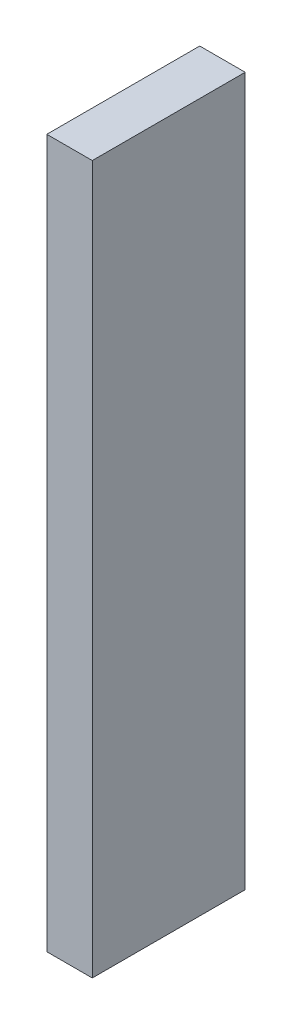
ISO-10303-21;
HEADER;
FILE_DESCRIPTION(('STEP AP214'),'2;1');
FILE_NAME('part.step','',(''),(''),'','','');
FILE_SCHEMA(('AUTOMOTIVE_DESIGN { 1 0 10303 214 1 1 1 1 }'));
ENDSEC;
DATA;
#1=APPLICATION_CONTEXT('core data for automotive mechanical design processes');
#2=APPLICATION_PROTOCOL_DEFINITION('international standard','automotive_design',2000,#1);
#3=PRODUCT_CONTEXT('',#1,'mechanical');
#4=PRODUCT('Part','Part','',(#3));
#5=PRODUCT_RELATED_PRODUCT_CATEGORY('part','',(#4));
#6=PRODUCT_DEFINITION_FORMATION('','',#4);
#7=PRODUCT_DEFINITION_CONTEXT('part definition',#1,'design');
#8=PRODUCT_DEFINITION('design','',#6,#7);
#9=PRODUCT_DEFINITION_SHAPE('','',#8);
#10=(LENGTH_UNIT() NAMED_UNIT(*) SI_UNIT(.MILLI.,.METRE.));
#11=(NAMED_UNIT(*) PLANE_ANGLE_UNIT() SI_UNIT($,.RADIAN.));
#12=(NAMED_UNIT(*) SI_UNIT($,.STERADIAN.) SOLID_ANGLE_UNIT());
#13=UNCERTAINTY_MEASURE_WITH_UNIT(LENGTH_MEASURE(1.E-05),#10,'distance_accuracy_value','');
#14=(GEOMETRIC_REPRESENTATION_CONTEXT(3) GLOBAL_UNCERTAINTY_ASSIGNED_CONTEXT((#13)) GLOBAL_UNIT_ASSIGNED_CONTEXT((#10,
#11,#12)) REPRESENTATION_CONTEXT('',''));
#15=CARTESIAN_POINT('',(0.,0.,0.));
#16=DIRECTION('',(0.,0.,1.));
#17=DIRECTION('',(1.,0.,0.));
#18=AXIS2_PLACEMENT_3D('',#15,#16,#17);
#19=CARTESIAN_POINT('',(130.275545204017,22.4180708263693,91.0720244776067));
#20=DIRECTION('',(-1.69244514382854E-09,0.,1.));
#21=DIRECTION('',(1.,0.,1.69244514382854E-09));
#22=AXIS2_PLACEMENT_3D('',#19,#20,#21);
#23=PLANE('',#22);
#24=DIRECTION('',(0.,-1.,0.));
#25=VECTOR('',#24,1.);
#26=CARTESIAN_POINT('',(131.25863030103,22.4180708263693,91.0720244792705));
#27=LINE('',#26,#25);
#28=CARTESIAN_POINT('',(131.25863030103,22.4180708263693,91.0720244792705));
#29=VERTEX_POINT('',#28);
#30=CARTESIAN_POINT('',(131.25863030103,7.11212965552236,91.0720244792705));
#31=VERTEX_POINT('',#30);
#32=EDGE_CURVE('E79',#29,#31,#27,.T.);
#33=ORIENTED_EDGE('',*,*,#32,.F.);
#34=DIRECTION('',(1.,0.,1.69244514382854E-09));
#35=VECTOR('',#34,1.);
#36=CARTESIAN_POINT('',(130.275545204017,22.4180708263693,91.0720244776067));
#37=LINE('',#36,#35);
#38=CARTESIAN_POINT('',(130.275545204017,22.4180708263693,91.0720244776067));
#39=VERTEX_POINT('',#38);
#40=EDGE_CURVE('E32',#39,#29,#37,.T.);
#41=ORIENTED_EDGE('',*,*,#40,.F.);
#42=DIRECTION('',(0.,-1.,0.));
#43=VECTOR('',#42,1.);
#44=CARTESIAN_POINT('',(130.275545204017,22.4180708263693,91.0720244776067));
#45=LINE('',#44,#43);
#46=CARTESIAN_POINT('',(130.275545204017,7.11212965552236,91.0720244776067));
#47=VERTEX_POINT('',#46);
#48=EDGE_CURVE('E71',#39,#47,#45,.T.);
#49=ORIENTED_EDGE('',*,*,#48,.T.);
#50=DIRECTION('',(1.,0.,1.69244514382854E-09));
#51=VECTOR('',#50,1.);
#52=CARTESIAN_POINT('',(130.275545204017,7.11212965552236,91.0720244776067));
#53=LINE('',#52,#51);
#54=EDGE_CURVE('E10',#47,#31,#53,.T.);
#55=ORIENTED_EDGE('',*,*,#54,.T.);
#56=EDGE_LOOP('',(#33,#41,#49,#55));
#57=FACE_BOUND('',#56,.T.);
#58=ADVANCED_FACE('F16',(#57),#23,.T.);
#59=CARTESIAN_POINT('',(130.275545204017,7.11212965552236,91.0720244776067));
#60=DIRECTION('',(0.,-1.,0.));
#61=DIRECTION('',(0.,0.,-1.));
#62=AXIS2_PLACEMENT_3D('',#59,#60,#61);
#63=PLANE('',#62);
#64=DIRECTION('',(1.69244514382854E-09,0.,-1.));
#65=VECTOR('',#64,1.);
#66=CARTESIAN_POINT('',(131.25863030103,7.11212965552236,91.0720244792705));
#67=LINE('',#66,#65);
#68=CARTESIAN_POINT('',(131.258630306625,7.11212965552235,87.7660833084218));
#69=VERTEX_POINT('',#68);
#70=EDGE_CURVE('E82',#31,#69,#67,.T.);
#71=ORIENTED_EDGE('',*,*,#70,.F.);
#72=ORIENTED_EDGE('',*,*,#54,.F.);
#73=DIRECTION('',(1.69244514382854E-09,0.,-1.));
#74=VECTOR('',#73,1.);
#75=CARTESIAN_POINT('',(130.275545204017,7.11212965552236,91.0720244776067));
#76=LINE('',#75,#74);
#77=CARTESIAN_POINT('',(130.275545209612,7.11212965552235,87.7660833067579));
#78=VERTEX_POINT('',#77);
#79=EDGE_CURVE('E67',#47,#78,#76,.T.);
#80=ORIENTED_EDGE('',*,*,#79,.T.);
#81=DIRECTION('',(1.,0.,1.69244514382854E-09));
#82=VECTOR('',#81,1.);
#83=CARTESIAN_POINT('',(130.275545209612,7.11212965552235,87.7660833067579));
#84=LINE('',#83,#82);
#85=EDGE_CURVE('E24',#78,#69,#84,.T.);
#86=ORIENTED_EDGE('',*,*,#85,.T.);
#87=EDGE_LOOP('',(#71,#72,#80,#86));
#88=FACE_BOUND('',#87,.T.);
#89=ADVANCED_FACE('F68',(#88),#63,.T.);
#90=CARTESIAN_POINT('',(130.275545209612,7.11212965552235,87.7660833067579));
#91=DIRECTION('',(1.69244514382854E-09,0.,-1.));
#92=DIRECTION('',(-1.,0.,-1.69244514382854E-09));
#93=AXIS2_PLACEMENT_3D('',#90,#91,#92);
#94=PLANE('',#93);
#95=DIRECTION('',(0.,1.,0.));
#96=VECTOR('',#95,1.);
#97=CARTESIAN_POINT('',(131.258630306625,7.11212965552235,87.7660833084218));
#98=LINE('',#97,#96);
#99=CARTESIAN_POINT('',(131.258630306625,22.418070826371,87.7660832999612));
#100=VERTEX_POINT('',#99);
#101=EDGE_CURVE('E65',#69,#100,#98,.T.);
#102=ORIENTED_EDGE('',*,*,#101,.F.);
#103=ORIENTED_EDGE('',*,*,#85,.F.);
#104=DIRECTION('',(0.,1.,0.));
#105=VECTOR('',#104,1.);
#106=CARTESIAN_POINT('',(130.275545209612,7.11212965552235,87.7660833067579));
#107=LINE('',#106,#105);
#108=CARTESIAN_POINT('',(130.275545209612,22.418070826371,87.7660832982974));
#109=VERTEX_POINT('',#108);
#110=EDGE_CURVE('E62',#78,#109,#107,.T.);
#111=ORIENTED_EDGE('',*,*,#110,.T.);
#112=DIRECTION('',(1.,0.,1.69244514382854E-09));
#113=VECTOR('',#112,1.);
#114=CARTESIAN_POINT('',(130.275545209612,22.418070826371,87.7660832982974));
#115=LINE('',#114,#113);
#116=EDGE_CURVE('E48',#109,#100,#115,.T.);
#117=ORIENTED_EDGE('',*,*,#116,.T.);
#118=EDGE_LOOP('',(#102,#103,#111,#117));
#119=FACE_BOUND('',#118,.T.);
#120=ADVANCED_FACE('F60',(#119),#94,.T.);
#121=CARTESIAN_POINT('',(130.275545209612,22.418070826371,87.7660832982974));
#122=DIRECTION('',(0.,1.,0.));
#123=DIRECTION('',(-1.,0.,0.));
#124=AXIS2_PLACEMENT_3D('',#121,#122,#123);
#125=PLANE('',#124);
#126=DIRECTION('',(-1.69244514382854E-09,0.,1.));
#127=VECTOR('',#126,1.);
#128=CARTESIAN_POINT('',(131.258630306625,22.418070826371,87.7660832999612));
#129=LINE('',#128,#127);
#130=EDGE_CURVE('E85',#100,#29,#129,.T.);
#131=ORIENTED_EDGE('',*,*,#130,.F.);
#132=ORIENTED_EDGE('',*,*,#116,.F.);
#133=DIRECTION('',(-1.69244514382854E-09,0.,1.));
#134=VECTOR('',#133,1.);
#135=CARTESIAN_POINT('',(130.275545209612,22.418070826371,87.7660832982974));
#136=LINE('',#135,#134);
#137=EDGE_CURVE('E74',#109,#39,#136,.T.);
#138=ORIENTED_EDGE('',*,*,#137,.T.);
#139=ORIENTED_EDGE('',*,*,#40,.T.);
#140=EDGE_LOOP('',(#131,#132,#138,#139));
#141=FACE_BOUND('',#140,.T.);
#142=ADVANCED_FACE('F96',(#141),#125,.T.);
#143=CARTESIAN_POINT('',(130.275545201028,17.2651002409467,92.8378607087388));
#144=DIRECTION('',(1.,0.,1.69244514382854E-09));
#145=DIRECTION('',(0.,1.,0.));
#146=AXIS2_PLACEMENT_3D('',#143,#144,#145);
#147=PLANE('',#146);
#148=ORIENTED_EDGE('',*,*,#48,.F.);
#149=ORIENTED_EDGE('',*,*,#137,.F.);
#150=ORIENTED_EDGE('',*,*,#110,.F.);
#151=ORIENTED_EDGE('',*,*,#79,.F.);
#152=EDGE_LOOP('',(#148,#149,#150,#151));
#153=FACE_BOUND('',#152,.T.);
#154=ADVANCED_FACE('F73',(#153),#147,.F.);
#155=CARTESIAN_POINT('',(131.258630298041,17.2651002409467,92.8378607104026));
#156=DIRECTION('',(1.,0.,1.69244514382854E-09));
#157=DIRECTION('',(0.,1.,0.));
#158=AXIS2_PLACEMENT_3D('',#155,#156,#157);
#159=PLANE('',#158);
#160=ORIENTED_EDGE('',*,*,#32,.T.);
#161=ORIENTED_EDGE('',*,*,#70,.T.);
#162=ORIENTED_EDGE('',*,*,#101,.T.);
#163=ORIENTED_EDGE('',*,*,#130,.T.);
#164=EDGE_LOOP('',(#160,#161,#162,#163));
#165=FACE_BOUND('',#164,.T.);
#166=ADVANCED_FACE('F89',(#165),#159,.T.);
#167=CLOSED_SHELL('',(#58,#89,#120,#142,#154,#166));
#168=MANIFOLD_SOLID_BREP('B1',#167);
#169=ADVANCED_BREP_SHAPE_REPRESENTATION('',(#18,#168),#14);
#170=SHAPE_DEFINITION_REPRESENTATION(#9,#169);
ENDSEC;
END-ISO-10303-21;
